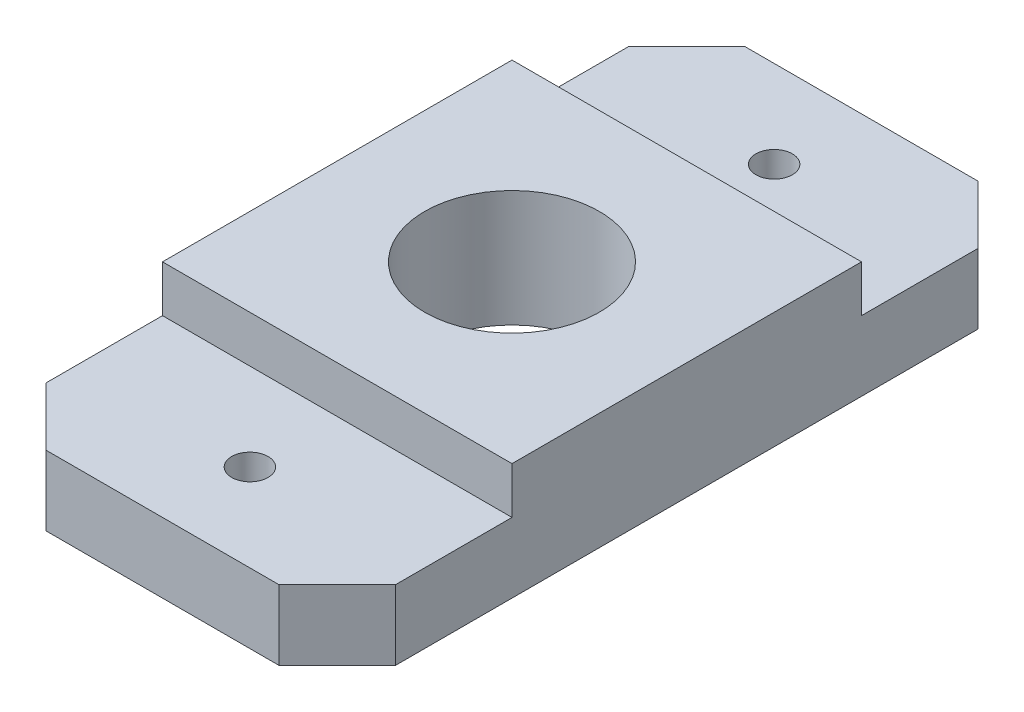
ISO-10303-21;
HEADER;
FILE_DESCRIPTION(('STEP AP214'),'2;1');
FILE_NAME('part.step','',(''),(''),'','','');
FILE_SCHEMA(('AUTOMOTIVE_DESIGN { 1 0 10303 214 1 1 1 1 }'));
ENDSEC;
DATA;
#1=APPLICATION_CONTEXT('core data for automotive mechanical design processes');
#2=APPLICATION_PROTOCOL_DEFINITION('international standard','automotive_design',2000,#1);
#3=PRODUCT_CONTEXT('',#1,'mechanical');
#4=PRODUCT('Part','Part','',(#3));
#5=PRODUCT_RELATED_PRODUCT_CATEGORY('part','',(#4));
#6=PRODUCT_DEFINITION_FORMATION('','',#4);
#7=PRODUCT_DEFINITION_CONTEXT('part definition',#1,'design');
#8=PRODUCT_DEFINITION('design','',#6,#7);
#9=PRODUCT_DEFINITION_SHAPE('','',#8);
#10=(LENGTH_UNIT() NAMED_UNIT(*) SI_UNIT(.MILLI.,.METRE.));
#11=(NAMED_UNIT(*) PLANE_ANGLE_UNIT() SI_UNIT($,.RADIAN.));
#12=(NAMED_UNIT(*) SI_UNIT($,.STERADIAN.) SOLID_ANGLE_UNIT());
#13=UNCERTAINTY_MEASURE_WITH_UNIT(LENGTH_MEASURE(1.E-05),#10,'distance_accuracy_value','');
#14=(GEOMETRIC_REPRESENTATION_CONTEXT(3) GLOBAL_UNCERTAINTY_ASSIGNED_CONTEXT((#13)) GLOBAL_UNIT_ASSIGNED_CONTEXT((#10,
#11,#12)) REPRESENTATION_CONTEXT('',''));
#15=CARTESIAN_POINT('',(0.,0.,0.));
#16=DIRECTION('',(0.,0.,1.));
#17=DIRECTION('',(1.,0.,0.));
#18=AXIS2_PLACEMENT_3D('',#15,#16,#17);
#19=CARTESIAN_POINT('',(0.,7.62,0.));
#20=DIRECTION('',(0.,-1.,0.));
#21=DIRECTION('',(0.,0.,-1.));
#22=AXIS2_PLACEMENT_3D('',#19,#20,#21);
#23=PLANE('',#22);
#24=CARTESIAN_POINT('',(0.,7.62,-28.575));
#25=DIRECTION('',(0.,-1.,0.));
#26=DIRECTION('',(0.,0.,-1.));
#27=AXIS2_PLACEMENT_3D('',#24,#25,#26);
#28=CIRCLE('',#27,1.984375);
#29=CARTESIAN_POINT('',(0.,7.62,-30.559375));
#30=VERTEX_POINT('',#29);
#31=EDGE_CURVE('E262',#30,#30,#28,.T.);
#32=ORIENTED_EDGE('',*,*,#31,.T.);
#33=EDGE_LOOP('',(#32));
#34=FACE_BOUND('',#33,.T.);
#35=DIRECTION('',(0.,0.,1.));
#36=VECTOR('',#35,1.);
#37=CARTESIAN_POINT('',(19.05,7.62,38.1));
#38=LINE('',#37,#36);
#39=CARTESIAN_POINT('',(19.05,7.62,-31.75));
#40=VERTEX_POINT('',#39);
#41=CARTESIAN_POINT('',(19.05,7.62,-19.05));
#42=VERTEX_POINT('',#41);
#43=EDGE_CURVE('E133',#40,#42,#38,.T.);
#44=ORIENTED_EDGE('',*,*,#43,.F.);
#45=DIRECTION('',(0.707106781186547,0.,0.707106781186548));
#46=VECTOR('',#45,1.);
#47=CARTESIAN_POINT('',(19.05,7.62,-31.7499999999999));
#48=LINE('',#47,#46);
#49=CARTESIAN_POINT('',(12.6999999999999,7.62,-38.1));
#50=VERTEX_POINT('',#49);
#51=EDGE_CURVE('E189',#40,#50,#48,.F.);
#52=ORIENTED_EDGE('',*,*,#51,.T.);
#53=DIRECTION('',(-1.,0.,0.));
#54=VECTOR('',#53,1.);
#55=CARTESIAN_POINT('',(-38.1,7.62,-38.1));
#56=LINE('',#55,#54);
#57=CARTESIAN_POINT('',(-12.7,7.62,-38.1));
#58=VERTEX_POINT('',#57);
#59=EDGE_CURVE('E165',#50,#58,#56,.T.);
#60=ORIENTED_EDGE('',*,*,#59,.T.);
#61=DIRECTION('',(-0.707106781186547,0.,0.707106781186548));
#62=VECTOR('',#61,1.);
#63=CARTESIAN_POINT('',(-12.7,7.62,-38.1));
#64=LINE('',#63,#62);
#65=CARTESIAN_POINT('',(-19.05,7.62,-31.75));
#66=VERTEX_POINT('',#65);
#67=EDGE_CURVE('E186',#58,#66,#64,.T.);
#68=ORIENTED_EDGE('',*,*,#67,.T.);
#69=DIRECTION('',(0.,0.,-1.));
#70=VECTOR('',#69,1.);
#71=CARTESIAN_POINT('',(-19.05,7.62,-38.1));
#72=LINE('',#71,#70);
#73=CARTESIAN_POINT('',(-19.05,7.62,-19.05));
#74=VERTEX_POINT('',#73);
#75=EDGE_CURVE('E240',#74,#66,#72,.T.);
#76=ORIENTED_EDGE('',*,*,#75,.F.);
#77=DIRECTION('',(1.,0.,0.));
#78=VECTOR('',#77,1.);
#79=CARTESIAN_POINT('',(-19.05,7.62,-19.05));
#80=LINE('',#79,#78);
#81=EDGE_CURVE('E144',#74,#42,#80,.T.);
#82=ORIENTED_EDGE('',*,*,#81,.T.);
#83=EDGE_LOOP('',(#44,#52,#60,#68,#76,#82));
#84=FACE_BOUND('',#83,.T.);
#85=ADVANCED_FACE('F37',(#34,#84),#23,.F.);
#86=CARTESIAN_POINT('',(-38.1,7.62,-38.1));
#87=DIRECTION('',(0.,0.,1.));
#88=DIRECTION('',(1.,0.,0.));
#89=AXIS2_PLACEMENT_3D('',#86,#87,#88);
#90=PLANE('',#89);
#91=ORIENTED_EDGE('',*,*,#59,.F.);
#92=DIRECTION('',(0.,-1.,0.));
#93=VECTOR('',#92,1.);
#94=CARTESIAN_POINT('',(12.7,7.62,-38.1));
#95=LINE('',#94,#93);
#96=CARTESIAN_POINT('',(12.6999999999999,0.,-38.1));
#97=VERTEX_POINT('',#96);
#98=EDGE_CURVE('E196',#50,#97,#95,.T.);
#99=ORIENTED_EDGE('',*,*,#98,.T.);
#100=DIRECTION('',(-1.,0.,0.));
#101=VECTOR('',#100,1.);
#102=CARTESIAN_POINT('',(-38.1,0.,-38.1));
#103=LINE('',#102,#101);
#104=CARTESIAN_POINT('',(-12.7,0.,-38.1));
#105=VERTEX_POINT('',#104);
#106=EDGE_CURVE('E155',#97,#105,#103,.T.);
#107=ORIENTED_EDGE('',*,*,#106,.T.);
#108=DIRECTION('',(0.,1.,0.));
#109=VECTOR('',#108,1.);
#110=CARTESIAN_POINT('',(-12.7,7.62,-38.1));
#111=LINE('',#110,#109);
#112=EDGE_CURVE('E192',#105,#58,#111,.T.);
#113=ORIENTED_EDGE('',*,*,#112,.T.);
#114=EDGE_LOOP('',(#91,#99,#107,#113));
#115=FACE_BOUND('',#114,.T.);
#116=ADVANCED_FACE('F298',(#115),#90,.F.);
#117=CARTESIAN_POINT('',(-38.1,7.62,38.1));
#118=DIRECTION('',(0.,0.,-1.));
#119=DIRECTION('',(-1.,0.,0.));
#120=AXIS2_PLACEMENT_3D('',#117,#118,#119);
#121=PLANE('',#120);
#122=DIRECTION('',(1.,0.,0.));
#123=VECTOR('',#122,1.);
#124=CARTESIAN_POINT('',(-38.1,0.,38.1));
#125=LINE('',#124,#123);
#126=CARTESIAN_POINT('',(-12.7,0.,38.1));
#127=VERTEX_POINT('',#126);
#128=CARTESIAN_POINT('',(12.7,0.,38.1));
#129=VERTEX_POINT('',#128);
#130=EDGE_CURVE('E170',#127,#129,#125,.T.);
#131=ORIENTED_EDGE('',*,*,#130,.T.);
#132=DIRECTION('',(0.,1.,0.));
#133=VECTOR('',#132,1.);
#134=CARTESIAN_POINT('',(12.7,7.62,38.1));
#135=LINE('',#134,#133);
#136=CARTESIAN_POINT('',(12.7,7.62,38.1));
#137=VERTEX_POINT('',#136);
#138=EDGE_CURVE('E221',#129,#137,#135,.T.);
#139=ORIENTED_EDGE('',*,*,#138,.T.);
#140=DIRECTION('',(1.,0.,0.));
#141=VECTOR('',#140,1.);
#142=CARTESIAN_POINT('',(-38.1,7.62,38.1));
#143=LINE('',#142,#141);
#144=CARTESIAN_POINT('',(-12.7,7.62,38.1));
#145=VERTEX_POINT('',#144);
#146=EDGE_CURVE('E169',#145,#137,#143,.T.);
#147=ORIENTED_EDGE('',*,*,#146,.F.);
#148=DIRECTION('',(0.,-1.,0.));
#149=VECTOR('',#148,1.);
#150=CARTESIAN_POINT('',(-12.7,0.,38.1));
#151=LINE('',#150,#149);
#152=EDGE_CURVE('E218',#145,#127,#151,.T.);
#153=ORIENTED_EDGE('',*,*,#152,.T.);
#154=EDGE_LOOP('',(#131,#139,#147,#153));
#155=FACE_BOUND('',#154,.T.);
#156=ADVANCED_FACE('F225',(#155),#121,.F.);
#157=CARTESIAN_POINT('',(0.,7.62,28.575));
#158=DIRECTION('',(0.,-1.,0.));
#159=DIRECTION('',(0.,0.,-1.));
#160=AXIS2_PLACEMENT_3D('',#157,#158,#159);
#161=CIRCLE('',#160,1.984375);
#162=CARTESIAN_POINT('',(0.,7.62,26.590625));
#163=VERTEX_POINT('',#162);
#164=EDGE_CURVE('E253',#163,#163,#161,.T.);
#165=ORIENTED_EDGE('',*,*,#164,.T.);
#166=EDGE_LOOP('',(#165));
#167=FACE_BOUND('',#166,.T.);
#168=ORIENTED_EDGE('',*,*,#146,.T.);
#169=DIRECTION('',(-0.707106781186547,0.,0.707106781186548));
#170=VECTOR('',#169,1.);
#171=CARTESIAN_POINT('',(12.7,7.62,38.1));
#172=LINE('',#171,#170);
#173=CARTESIAN_POINT('',(19.05,7.62,31.75));
#174=VERTEX_POINT('',#173);
#175=EDGE_CURVE('E11',#137,#174,#172,.F.);
#176=ORIENTED_EDGE('',*,*,#175,.T.);
#177=CARTESIAN_POINT('',(19.05,7.62,19.05));
#178=VERTEX_POINT('',#177);
#179=EDGE_CURVE('E125',#178,#174,#38,.T.);
#180=ORIENTED_EDGE('',*,*,#179,.F.);
#181=DIRECTION('',(1.,0.,0.));
#182=VECTOR('',#181,1.);
#183=CARTESIAN_POINT('',(-19.05,7.62,19.05));
#184=LINE('',#183,#182);
#185=CARTESIAN_POINT('',(-19.05,7.62,19.05));
#186=VERTEX_POINT('',#185);
#187=EDGE_CURVE('E128',#186,#178,#184,.T.);
#188=ORIENTED_EDGE('',*,*,#187,.F.);
#189=CARTESIAN_POINT('',(-19.05,7.62,31.7499999999999));
#190=VERTEX_POINT('',#189);
#191=EDGE_CURVE('E245',#190,#186,#72,.T.);
#192=ORIENTED_EDGE('',*,*,#191,.F.);
#193=DIRECTION('',(0.707106781186547,0.,0.707106781186548));
#194=VECTOR('',#193,1.);
#195=CARTESIAN_POINT('',(-19.05,7.62,31.75));
#196=LINE('',#195,#194);
#197=EDGE_CURVE('E46',#190,#145,#196,.T.);
#198=ORIENTED_EDGE('',*,*,#197,.T.);
#199=EDGE_LOOP('',(#168,#176,#180,#188,#192,#198));
#200=FACE_BOUND('',#199,.T.);
#201=ADVANCED_FACE('F127',(#167,#200),#23,.F.);
#202=CARTESIAN_POINT('',(0.,0.,0.));
#203=DIRECTION('',(0.,-1.,0.));
#204=DIRECTION('',(0.,0.,-1.));
#205=AXIS2_PLACEMENT_3D('',#202,#203,#204);
#206=PLANE('',#205);
#207=ORIENTED_EDGE('',*,*,#106,.F.);
#208=DIRECTION('',(-0.707106781186547,0.,-0.707106781186548));
#209=VECTOR('',#208,1.);
#210=CARTESIAN_POINT('',(25.4,0.,-25.3999999999999));
#211=LINE('',#210,#209);
#212=CARTESIAN_POINT('',(19.05,0.,-31.7499999999999));
#213=VERTEX_POINT('',#212);
#214=EDGE_CURVE('E208',#97,#213,#211,.F.);
#215=ORIENTED_EDGE('',*,*,#214,.T.);
#216=DIRECTION('',(0.,0.,1.));
#217=VECTOR('',#216,1.);
#218=CARTESIAN_POINT('',(19.05,0.,-38.0999999999999));
#219=LINE('',#218,#217);
#220=CARTESIAN_POINT('',(19.05,0.,31.75));
#221=VERTEX_POINT('',#220);
#222=EDGE_CURVE('E236',#213,#221,#219,.T.);
#223=ORIENTED_EDGE('',*,*,#222,.T.);
#224=DIRECTION('',(0.707106781186547,0.,-0.707106781186548));
#225=VECTOR('',#224,1.);
#226=CARTESIAN_POINT('',(25.4,0.,25.4));
#227=LINE('',#226,#225);
#228=EDGE_CURVE('E202',#221,#129,#227,.F.);
#229=ORIENTED_EDGE('',*,*,#228,.T.);
#230=ORIENTED_EDGE('',*,*,#130,.F.);
#231=DIRECTION('',(-0.707106781186547,0.,-0.707106781186548));
#232=VECTOR('',#231,1.);
#233=CARTESIAN_POINT('',(-25.4,0.,25.4));
#234=LINE('',#233,#232);
#235=CARTESIAN_POINT('',(-19.05,0.,31.75));
#236=VERTEX_POINT('',#235);
#237=EDGE_CURVE('E199',#127,#236,#234,.T.);
#238=ORIENTED_EDGE('',*,*,#237,.T.);
#239=DIRECTION('',(0.,0.,-1.));
#240=VECTOR('',#239,1.);
#241=CARTESIAN_POINT('',(-19.05,0.,38.1));
#242=LINE('',#241,#240);
#243=CARTESIAN_POINT('',(-19.05,0.,-31.75));
#244=VERTEX_POINT('',#243);
#245=EDGE_CURVE('E258',#236,#244,#242,.T.);
#246=ORIENTED_EDGE('',*,*,#245,.T.);
#247=DIRECTION('',(0.707106781186547,0.,-0.707106781186548));
#248=VECTOR('',#247,1.);
#249=CARTESIAN_POINT('',(-25.4,0.,-25.4));
#250=LINE('',#249,#248);
#251=EDGE_CURVE('E205',#244,#105,#250,.T.);
#252=ORIENTED_EDGE('',*,*,#251,.T.);
#253=EDGE_LOOP('',(#207,#215,#223,#229,#230,#238,#246,#252));
#254=FACE_BOUND('',#253,.T.);
#255=CARTESIAN_POINT('',(0.,0.,-28.575));
#256=DIRECTION('',(0.,1.,0.));
#257=DIRECTION('',(0.,0.,1.));
#258=AXIS2_PLACEMENT_3D('',#255,#256,#257);
#259=CIRCLE('',#258,1.984375);
#260=CARTESIAN_POINT('',(0.,0.,-26.590625));
#261=VERTEX_POINT('',#260);
#262=EDGE_CURVE('E249',#261,#261,#259,.T.);
#263=ORIENTED_EDGE('',*,*,#262,.T.);
#264=EDGE_LOOP('',(#263));
#265=FACE_BOUND('',#264,.T.);
#266=CARTESIAN_POINT('',(0.,0.,28.575));
#267=DIRECTION('',(0.,1.,0.));
#268=DIRECTION('',(0.,0.,-1.));
#269=AXIS2_PLACEMENT_3D('',#266,#267,#268);
#270=CIRCLE('',#269,1.984375);
#271=CARTESIAN_POINT('',(0.,0.,26.590625));
#272=VERTEX_POINT('',#271);
#273=EDGE_CURVE('E254',#272,#272,#270,.T.);
#274=ORIENTED_EDGE('',*,*,#273,.T.);
#275=EDGE_LOOP('',(#274));
#276=FACE_BOUND('',#275,.T.);
#277=CARTESIAN_POINT('',(0.,0.,0.));
#278=DIRECTION('',(0.,1.,0.));
#279=DIRECTION('',(0.,0.,1.));
#280=AXIS2_PLACEMENT_3D('',#277,#278,#279);
#281=CIRCLE('',#280,9.525);
#282=CARTESIAN_POINT('',(0.,0.,9.525));
#283=VERTEX_POINT('',#282);
#284=EDGE_CURVE('E267',#283,#283,#281,.T.);
#285=ORIENTED_EDGE('',*,*,#284,.T.);
#286=EDGE_LOOP('',(#285));
#287=FACE_BOUND('',#286,.T.);
#288=ADVANCED_FACE('F233',(#254,#265,#276,#287),#206,.T.);
#289=CARTESIAN_POINT('',(-19.05,12.7,19.05));
#290=DIRECTION('',(-1.,0.,0.));
#291=DIRECTION('',(0.,0.,1.));
#292=AXIS2_PLACEMENT_3D('',#289,#290,#291);
#293=PLANE('',#292);
#294=ORIENTED_EDGE('',*,*,#75,.T.);
#295=DIRECTION('',(0.,-1.,0.));
#296=VECTOR('',#295,1.);
#297=CARTESIAN_POINT('',(-19.05,0.,-31.75));
#298=LINE('',#297,#296);
#299=EDGE_CURVE('E215',#66,#244,#298,.T.);
#300=ORIENTED_EDGE('',*,*,#299,.T.);
#301=ORIENTED_EDGE('',*,*,#245,.F.);
#302=DIRECTION('',(0.,1.,0.));
#303=VECTOR('',#302,1.);
#304=CARTESIAN_POINT('',(-19.05,7.62,31.75));
#305=LINE('',#304,#303);
#306=EDGE_CURVE('E211',#236,#190,#305,.T.);
#307=ORIENTED_EDGE('',*,*,#306,.T.);
#308=ORIENTED_EDGE('',*,*,#191,.T.);
#309=DIRECTION('',(0.,-1.,0.));
#310=VECTOR('',#309,1.);
#311=CARTESIAN_POINT('',(-19.05,12.7,19.05));
#312=LINE('',#311,#310);
#313=CARTESIAN_POINT('',(-19.05,12.7,19.05));
#314=VERTEX_POINT('',#313);
#315=EDGE_CURVE('E141',#314,#186,#312,.T.);
#316=ORIENTED_EDGE('',*,*,#315,.F.);
#317=DIRECTION('',(0.,0.,-1.));
#318=VECTOR('',#317,1.);
#319=CARTESIAN_POINT('',(-19.05,12.7,19.05));
#320=LINE('',#319,#318);
#321=CARTESIAN_POINT('',(-19.05,12.7,-19.05));
#322=VERTEX_POINT('',#321);
#323=EDGE_CURVE('E143',#314,#322,#320,.T.);
#324=ORIENTED_EDGE('',*,*,#323,.T.);
#325=DIRECTION('',(0.,-1.,0.));
#326=VECTOR('',#325,1.);
#327=CARTESIAN_POINT('',(-19.05,12.7,-19.05));
#328=LINE('',#327,#326);
#329=EDGE_CURVE('E158',#322,#74,#328,.T.);
#330=ORIENTED_EDGE('',*,*,#329,.T.);
#331=EDGE_LOOP('',(#294,#300,#301,#307,#308,#316,#324,#330));
#332=FACE_BOUND('',#331,.T.);
#333=ADVANCED_FACE('F305',(#332),#293,.T.);
#334=CARTESIAN_POINT('',(-19.05,12.7,19.05));
#335=DIRECTION('',(0.,0.,-1.));
#336=DIRECTION('',(-1.,0.,0.));
#337=AXIS2_PLACEMENT_3D('',#334,#335,#336);
#338=PLANE('',#337);
#339=ORIENTED_EDGE('',*,*,#187,.T.);
#340=DIRECTION('',(0.,-1.,0.));
#341=VECTOR('',#340,1.);
#342=CARTESIAN_POINT('',(19.05,12.7,19.05));
#343=LINE('',#342,#341);
#344=CARTESIAN_POINT('',(19.05,12.7,19.05));
#345=VERTEX_POINT('',#344);
#346=EDGE_CURVE('E139',#345,#178,#343,.T.);
#347=ORIENTED_EDGE('',*,*,#346,.F.);
#348=DIRECTION('',(1.,0.,0.));
#349=VECTOR('',#348,1.);
#350=CARTESIAN_POINT('',(-19.05,12.7,19.05));
#351=LINE('',#350,#349);
#352=EDGE_CURVE('E164',#314,#345,#351,.T.);
#353=ORIENTED_EDGE('',*,*,#352,.F.);
#354=ORIENTED_EDGE('',*,*,#315,.T.);
#355=EDGE_LOOP('',(#339,#347,#353,#354));
#356=FACE_BOUND('',#355,.T.);
#357=ADVANCED_FACE('F137',(#356),#338,.F.);
#358=CARTESIAN_POINT('',(19.05,12.7,19.05));
#359=DIRECTION('',(-1.,0.,0.));
#360=DIRECTION('',(0.,0.,1.));
#361=AXIS2_PLACEMENT_3D('',#358,#359,#360);
#362=PLANE('',#361);
#363=ORIENTED_EDGE('',*,*,#222,.F.);
#364=DIRECTION('',(0.,1.,0.));
#365=VECTOR('',#364,1.);
#366=CARTESIAN_POINT('',(19.05,12.7,-31.7499999999999));
#367=LINE('',#366,#365);
#368=EDGE_CURVE('E182',#213,#40,#367,.T.);
#369=ORIENTED_EDGE('',*,*,#368,.T.);
#370=ORIENTED_EDGE('',*,*,#43,.T.);
#371=DIRECTION('',(0.,-1.,0.));
#372=VECTOR('',#371,1.);
#373=CARTESIAN_POINT('',(19.05,12.7,-19.05));
#374=LINE('',#373,#372);
#375=CARTESIAN_POINT('',(19.05,12.7,-19.05));
#376=VERTEX_POINT('',#375);
#377=EDGE_CURVE('E151',#376,#42,#374,.T.);
#378=ORIENTED_EDGE('',*,*,#377,.F.);
#379=DIRECTION('',(0.,0.,-1.));
#380=VECTOR('',#379,1.);
#381=CARTESIAN_POINT('',(19.05,12.7,19.05));
#382=LINE('',#381,#380);
#383=EDGE_CURVE('E149',#345,#376,#382,.T.);
#384=ORIENTED_EDGE('',*,*,#383,.F.);
#385=ORIENTED_EDGE('',*,*,#346,.T.);
#386=ORIENTED_EDGE('',*,*,#179,.T.);
#387=DIRECTION('',(0.,-1.,0.));
#388=VECTOR('',#387,1.);
#389=CARTESIAN_POINT('',(19.05,12.7,31.75));
#390=LINE('',#389,#388);
#391=EDGE_CURVE('E173',#174,#221,#390,.T.);
#392=ORIENTED_EDGE('',*,*,#391,.T.);
#393=EDGE_LOOP('',(#363,#369,#370,#378,#384,#385,#386,#392));
#394=FACE_BOUND('',#393,.T.);
#395=ADVANCED_FACE('F147',(#394),#362,.F.);
#396=CARTESIAN_POINT('',(-19.05,12.7,-19.05));
#397=DIRECTION('',(0.,0.,-1.));
#398=DIRECTION('',(-1.,0.,0.));
#399=AXIS2_PLACEMENT_3D('',#396,#397,#398);
#400=PLANE('',#399);
#401=ORIENTED_EDGE('',*,*,#81,.F.);
#402=ORIENTED_EDGE('',*,*,#329,.F.);
#403=DIRECTION('',(1.,0.,0.));
#404=VECTOR('',#403,1.);
#405=CARTESIAN_POINT('',(-19.05,12.7,-19.05));
#406=LINE('',#405,#404);
#407=EDGE_CURVE('E277',#322,#376,#406,.T.);
#408=ORIENTED_EDGE('',*,*,#407,.T.);
#409=ORIENTED_EDGE('',*,*,#377,.T.);
#410=EDGE_LOOP('',(#401,#402,#408,#409));
#411=FACE_BOUND('',#410,.T.);
#412=ADVANCED_FACE('F291',(#411),#400,.T.);
#413=CARTESIAN_POINT('',(0.,12.7,0.));
#414=DIRECTION('',(0.,-1.,0.));
#415=DIRECTION('',(0.,0.,-1.));
#416=AXIS2_PLACEMENT_3D('',#413,#414,#415);
#417=PLANE('',#416);
#418=CARTESIAN_POINT('',(0.,12.7,0.));
#419=DIRECTION('',(0.,1.,0.));
#420=DIRECTION('',(0.,0.,1.));
#421=AXIS2_PLACEMENT_3D('',#418,#419,#420);
#422=CIRCLE('',#421,9.525);
#423=CARTESIAN_POINT('',(0.,12.7,9.525));
#424=VERTEX_POINT('',#423);
#425=EDGE_CURVE('E266',#424,#424,#422,.T.);
#426=ORIENTED_EDGE('',*,*,#425,.F.);
#427=EDGE_LOOP('',(#426));
#428=FACE_BOUND('',#427,.T.);
#429=ORIENTED_EDGE('',*,*,#323,.F.);
#430=ORIENTED_EDGE('',*,*,#352,.T.);
#431=ORIENTED_EDGE('',*,*,#383,.T.);
#432=ORIENTED_EDGE('',*,*,#407,.F.);
#433=EDGE_LOOP('',(#429,#430,#431,#432));
#434=FACE_BOUND('',#433,.T.);
#435=ADVANCED_FACE('F310',(#428,#434),#417,.F.);
#436=CARTESIAN_POINT('',(0.,0.,0.));
#437=DIRECTION('',(0.,1.,0.));
#438=DIRECTION('',(0.,0.,1.));
#439=AXIS2_PLACEMENT_3D('',#436,#437,#438);
#440=CYLINDRICAL_SURFACE('',#439,9.525);
#441=ORIENTED_EDGE('',*,*,#284,.F.);
#442=EDGE_LOOP('',(#441));
#443=FACE_BOUND('',#442,.T.);
#444=ORIENTED_EDGE('',*,*,#425,.T.);
#445=EDGE_LOOP('',(#444));
#446=FACE_BOUND('',#445,.T.);
#447=ADVANCED_FACE('F312',(#443,#446),#440,.F.);
#448=CARTESIAN_POINT('',(0.,0.,28.575));
#449=DIRECTION('',(0.,1.,0.));
#450=DIRECTION('',(0.,0.,1.));
#451=AXIS2_PLACEMENT_3D('',#448,#449,#450);
#452=CYLINDRICAL_SURFACE('',#451,1.984375);
#453=ORIENTED_EDGE('',*,*,#273,.F.);
#454=EDGE_LOOP('',(#453));
#455=FACE_BOUND('',#454,.T.);
#456=ORIENTED_EDGE('',*,*,#164,.F.);
#457=EDGE_LOOP('',(#456));
#458=FACE_BOUND('',#457,.T.);
#459=ADVANCED_FACE('F319',(#455,#458),#452,.F.);
#460=CARTESIAN_POINT('',(0.,0.,-28.575));
#461=DIRECTION('',(0.,1.,0.));
#462=DIRECTION('',(0.,0.,1.));
#463=AXIS2_PLACEMENT_3D('',#460,#461,#462);
#464=CYLINDRICAL_SURFACE('',#463,1.984375);
#465=ORIENTED_EDGE('',*,*,#262,.F.);
#466=EDGE_LOOP('',(#465));
#467=FACE_BOUND('',#466,.T.);
#468=ORIENTED_EDGE('',*,*,#31,.F.);
#469=EDGE_LOOP('',(#468));
#470=FACE_BOUND('',#469,.T.);
#471=ADVANCED_FACE('F344',(#467,#470),#464,.F.);
#472=CARTESIAN_POINT('',(19.05,12.7,-31.7499999999999));
#473=DIRECTION('',(-0.707106781186548,0.,0.707106781186547));
#474=DIRECTION('',(0.,1.,0.));
#475=AXIS2_PLACEMENT_3D('',#472,#473,#474);
#476=PLANE('',#475);
#477=ORIENTED_EDGE('',*,*,#214,.F.);
#478=ORIENTED_EDGE('',*,*,#98,.F.);
#479=ORIENTED_EDGE('',*,*,#51,.F.);
#480=ORIENTED_EDGE('',*,*,#368,.F.);
#481=EDGE_LOOP('',(#477,#478,#479,#480));
#482=FACE_BOUND('',#481,.T.);
#483=ADVANCED_FACE('F294',(#482),#476,.F.);
#484=CARTESIAN_POINT('',(-12.7,7.62,-38.1));
#485=DIRECTION('',(-0.707106781186548,0.,-0.707106781186547));
#486=DIRECTION('',(0.,-1.,0.));
#487=AXIS2_PLACEMENT_3D('',#484,#485,#486);
#488=PLANE('',#487);
#489=ORIENTED_EDGE('',*,*,#251,.F.);
#490=ORIENTED_EDGE('',*,*,#299,.F.);
#491=ORIENTED_EDGE('',*,*,#67,.F.);
#492=ORIENTED_EDGE('',*,*,#112,.F.);
#493=EDGE_LOOP('',(#489,#490,#491,#492));
#494=FACE_BOUND('',#493,.T.);
#495=ADVANCED_FACE('F302',(#494),#488,.T.);
#496=CARTESIAN_POINT('',(12.7,7.62,38.1));
#497=DIRECTION('',(-0.707106781186548,0.,-0.707106781186547));
#498=DIRECTION('',(0.,1.,0.));
#499=AXIS2_PLACEMENT_3D('',#496,#497,#498);
#500=PLANE('',#499);
#501=ORIENTED_EDGE('',*,*,#228,.F.);
#502=ORIENTED_EDGE('',*,*,#391,.F.);
#503=ORIENTED_EDGE('',*,*,#175,.F.);
#504=ORIENTED_EDGE('',*,*,#138,.F.);
#505=EDGE_LOOP('',(#501,#502,#503,#504));
#506=FACE_BOUND('',#505,.T.);
#507=ADVANCED_FACE('F229',(#506),#500,.F.);
#508=CARTESIAN_POINT('',(-19.05,12.7,31.75));
#509=DIRECTION('',(-0.707106781186548,0.,0.707106781186547));
#510=DIRECTION('',(0.,-1.,0.));
#511=AXIS2_PLACEMENT_3D('',#508,#509,#510);
#512=PLANE('',#511);
#513=ORIENTED_EDGE('',*,*,#237,.F.);
#514=ORIENTED_EDGE('',*,*,#152,.F.);
#515=ORIENTED_EDGE('',*,*,#197,.F.);
#516=ORIENTED_EDGE('',*,*,#306,.F.);
#517=EDGE_LOOP('',(#513,#514,#515,#516));
#518=FACE_BOUND('',#517,.T.);
#519=ADVANCED_FACE('F39',(#518),#512,.T.);
#520=CLOSED_SHELL('',(#85,#116,#156,#201,#288,#333,#357,#395,#412,#435,#447,#459,#471,#483,#495,
#507,#519));
#521=MANIFOLD_SOLID_BREP('B2',#520);
#522=ADVANCED_BREP_SHAPE_REPRESENTATION('',(#18,#521),#14);
#523=SHAPE_DEFINITION_REPRESENTATION(#9,#522);
ENDSEC;
END-ISO-10303-21;
